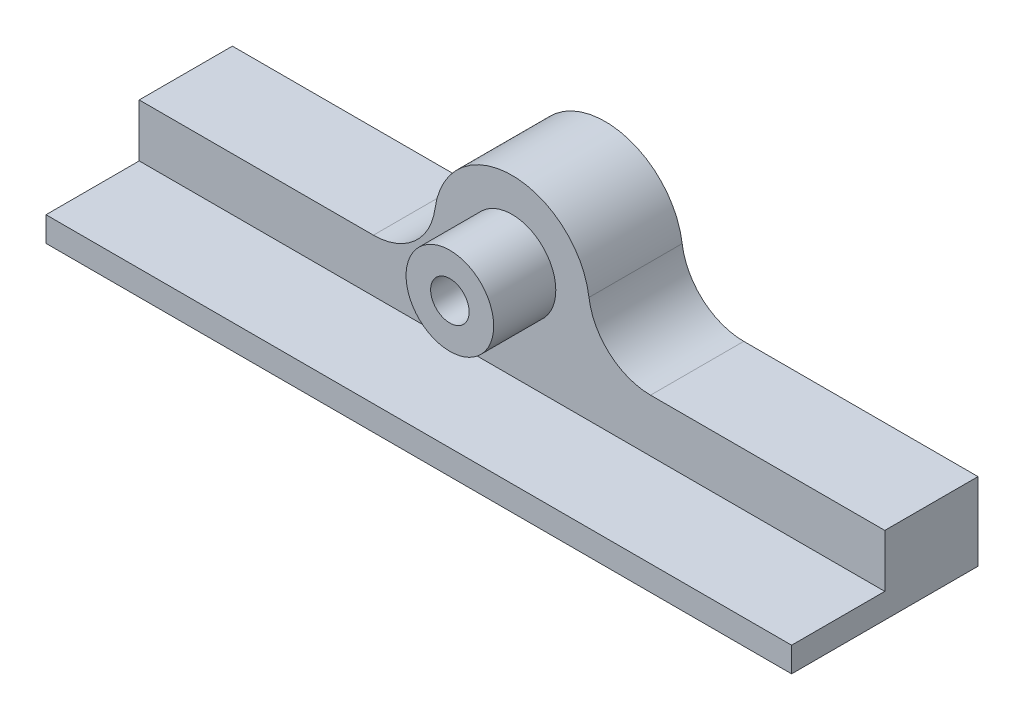
ISO-10303-21;
HEADER;
FILE_DESCRIPTION(('STEP AP214'),'2;1');
FILE_NAME('part.step','',(''),(''),'','','');
FILE_SCHEMA(('AUTOMOTIVE_DESIGN { 1 0 10303 214 1 1 1 1 }'));
ENDSEC;
DATA;
#1=APPLICATION_CONTEXT('core data for automotive mechanical design processes');
#2=APPLICATION_PROTOCOL_DEFINITION('international standard','automotive_design',2000,#1);
#3=PRODUCT_CONTEXT('',#1,'mechanical');
#4=PRODUCT('Part','Part','',(#3));
#5=PRODUCT_RELATED_PRODUCT_CATEGORY('part','',(#4));
#6=PRODUCT_DEFINITION_FORMATION('','',#4);
#7=PRODUCT_DEFINITION_CONTEXT('part definition',#1,'design');
#8=PRODUCT_DEFINITION('design','',#6,#7);
#9=PRODUCT_DEFINITION_SHAPE('','',#8);
#10=(LENGTH_UNIT() NAMED_UNIT(*) SI_UNIT(.MILLI.,.METRE.));
#11=(NAMED_UNIT(*) PLANE_ANGLE_UNIT() SI_UNIT($,.RADIAN.));
#12=(NAMED_UNIT(*) SI_UNIT($,.STERADIAN.) SOLID_ANGLE_UNIT());
#13=UNCERTAINTY_MEASURE_WITH_UNIT(LENGTH_MEASURE(1.E-05),#10,'distance_accuracy_value','');
#14=(GEOMETRIC_REPRESENTATION_CONTEXT(3) GLOBAL_UNCERTAINTY_ASSIGNED_CONTEXT((#13)) GLOBAL_UNIT_ASSIGNED_CONTEXT((#10,
#11,#12)) REPRESENTATION_CONTEXT('',''));
#15=CARTESIAN_POINT('',(0.,0.,0.));
#16=DIRECTION('',(0.,0.,1.));
#17=DIRECTION('',(1.,0.,0.));
#18=AXIS2_PLACEMENT_3D('',#15,#16,#17);
#19=CARTESIAN_POINT('',(0.,0.,0.));
#20=DIRECTION('',(0.,0.,1.));
#21=DIRECTION('',(1.,0.,0.));
#22=AXIS2_PLACEMENT_3D('',#19,#20,#21);
#23=PLANE('',#22);
#24=CARTESIAN_POINT('',(0.,0.,0.));
#25=DIRECTION('',(0.,0.,1.));
#26=DIRECTION('',(1.,0.,0.));
#27=AXIS2_PLACEMENT_3D('',#24,#25,#26);
#28=CIRCLE('',#27,7.05000000000001);
#29=CARTESIAN_POINT('',(7.05000000000001,0.,0.));
#30=VERTEX_POINT('',#29);
#31=EDGE_CURVE('E178',#30,#30,#28,.F.);
#32=ORIENTED_EDGE('',*,*,#31,.T.);
#33=EDGE_LOOP('',(#32));
#34=FACE_BOUND('',#33,.T.);
#35=DIRECTION('',(0.,1.,0.));
#36=VECTOR('',#35,1.);
#37=CARTESIAN_POINT('',(-60.,0.,0.));
#38=LINE('',#37,#36);
#39=CARTESIAN_POINT('',(-60.,-15.5,0.));
#40=VERTEX_POINT('',#39);
#41=CARTESIAN_POINT('',(-60.,-6.99999999999999,0.));
#42=VERTEX_POINT('',#41);
#43=EDGE_CURVE('E165',#40,#42,#38,.T.);
#44=ORIENTED_EDGE('',*,*,#43,.F.);
#45=DIRECTION('',(-1.,0.,0.));
#46=VECTOR('',#45,1.);
#47=CARTESIAN_POINT('',(-60.,-15.5,0.));
#48=LINE('',#47,#46);
#49=CARTESIAN_POINT('',(60.,-15.5,0.));
#50=VERTEX_POINT('',#49);
#51=EDGE_CURVE('E136',#50,#40,#48,.T.);
#52=ORIENTED_EDGE('',*,*,#51,.F.);
#53=DIRECTION('',(0.,1.,0.));
#54=VECTOR('',#53,1.);
#55=CARTESIAN_POINT('',(60.,0.,0.));
#56=LINE('',#55,#54);
#57=CARTESIAN_POINT('',(60.,-7.00000000000001,0.));
#58=VERTEX_POINT('',#57);
#59=EDGE_CURVE('E163',#50,#58,#56,.T.);
#60=ORIENTED_EDGE('',*,*,#59,.T.);
#61=DIRECTION('',(-1.,0.,0.));
#62=VECTOR('',#61,1.);
#63=CARTESIAN_POINT('',(0.,-7.00000000000001,0.));
#64=LINE('',#63,#62);
#65=CARTESIAN_POINT('',(22.2991031209778,-7.00000000000001,0.));
#66=VERTEX_POINT('',#65);
#67=EDGE_CURVE('E145',#58,#66,#64,.T.);
#68=ORIENTED_EDGE('',*,*,#67,.T.);
#69=CARTESIAN_POINT('',(22.2991031209778,2.99999999999999,0.));
#70=DIRECTION('',(0.,0.,1.));
#71=DIRECTION('',(1.,0.,0.));
#72=AXIS2_PLACEMENT_3D('',#69,#70,#71);
#73=CIRCLE('',#72,10.);
#74=CARTESIAN_POINT('',(12.3883906227654,1.66666666666666,0.));
#75=VERTEX_POINT('',#74);
#76=EDGE_CURVE('E45',#66,#75,#73,.F.);
#77=ORIENTED_EDGE('',*,*,#76,.T.);
#78=CARTESIAN_POINT('',(0.,0.,0.));
#79=DIRECTION('',(0.,0.,1.));
#80=DIRECTION('',(1.,0.,0.));
#81=AXIS2_PLACEMENT_3D('',#78,#79,#80);
#82=CIRCLE('',#81,12.5);
#83=CARTESIAN_POINT('',(-12.3883906227654,1.66666666666667,0.));
#84=VERTEX_POINT('',#83);
#85=EDGE_CURVE('E149',#75,#84,#82,.T.);
#86=ORIENTED_EDGE('',*,*,#85,.T.);
#87=CARTESIAN_POINT('',(-22.2991031209778,3.,0.));
#88=DIRECTION('',(0.,0.,1.));
#89=DIRECTION('',(1.,0.,0.));
#90=AXIS2_PLACEMENT_3D('',#87,#88,#89);
#91=CIRCLE('',#90,10.);
#92=CARTESIAN_POINT('',(-22.2991031209778,-7.,0.));
#93=VERTEX_POINT('',#92);
#94=EDGE_CURVE('E200',#84,#93,#91,.F.);
#95=ORIENTED_EDGE('',*,*,#94,.T.);
#96=DIRECTION('',(1.,0.,0.));
#97=VECTOR('',#96,1.);
#98=CARTESIAN_POINT('',(0.,-7.00000000000001,0.));
#99=LINE('',#98,#97);
#100=EDGE_CURVE('E167',#42,#93,#99,.T.);
#101=ORIENTED_EDGE('',*,*,#100,.F.);
#102=EDGE_LOOP('',(#44,#52,#60,#68,#77,#86,#95,#101));
#103=FACE_BOUND('',#102,.T.);
#104=ADVANCED_FACE('F37',(#34,#103),#23,.T.);
#105=CARTESIAN_POINT('',(0.,0.,10.));
#106=DIRECTION('',(0.,0.,-1.));
#107=DIRECTION('',(-1.,0.,0.));
#108=AXIS2_PLACEMENT_3D('',#105,#106,#107);
#109=CYLINDRICAL_SURFACE('',#108,7.05000000000001);
#110=CARTESIAN_POINT('',(0.,0.,10.));
#111=DIRECTION('',(0.,0.,1.));
#112=DIRECTION('',(1.,0.,0.));
#113=AXIS2_PLACEMENT_3D('',#110,#111,#112);
#114=CIRCLE('',#113,7.05000000000001);
#115=CARTESIAN_POINT('',(7.05000000000001,0.,10.));
#116=VERTEX_POINT('',#115);
#117=EDGE_CURVE('E179',#116,#116,#114,.F.);
#118=ORIENTED_EDGE('',*,*,#117,.T.);
#119=EDGE_LOOP('',(#118));
#120=FACE_BOUND('',#119,.T.);
#121=ORIENTED_EDGE('',*,*,#31,.F.);
#122=EDGE_LOOP('',(#121));
#123=FACE_BOUND('',#122,.T.);
#124=ADVANCED_FACE('F240',(#120,#123),#109,.T.);
#125=CARTESIAN_POINT('',(0.,0.,10.));
#126=DIRECTION('',(0.,0.,-1.));
#127=DIRECTION('',(-1.,0.,0.));
#128=AXIS2_PLACEMENT_3D('',#125,#126,#127);
#129=CYLINDRICAL_SURFACE('',#128,3.1);
#130=CARTESIAN_POINT('',(0.,0.,10.));
#131=DIRECTION('',(0.,0.,1.));
#132=DIRECTION('',(1.,0.,0.));
#133=AXIS2_PLACEMENT_3D('',#130,#131,#132);
#134=CIRCLE('',#133,3.1);
#135=CARTESIAN_POINT('',(3.1,0.,10.));
#136=VERTEX_POINT('',#135);
#137=EDGE_CURVE('E182',#136,#136,#134,.T.);
#138=ORIENTED_EDGE('',*,*,#137,.T.);
#139=EDGE_LOOP('',(#138));
#140=FACE_BOUND('',#139,.T.);
#141=CARTESIAN_POINT('',(0.,0.,0.));
#142=DIRECTION('',(0.,0.,1.));
#143=DIRECTION('',(1.,0.,0.));
#144=AXIS2_PLACEMENT_3D('',#141,#142,#143);
#145=CIRCLE('',#144,3.1);
#146=CARTESIAN_POINT('',(3.1,0.,0.));
#147=VERTEX_POINT('',#146);
#148=EDGE_CURVE('E183',#147,#147,#145,.T.);
#149=ORIENTED_EDGE('',*,*,#148,.F.);
#150=EDGE_LOOP('',(#149));
#151=FACE_BOUND('',#150,.T.);
#152=ADVANCED_FACE('F247',(#140,#151),#129,.F.);
#153=CARTESIAN_POINT('',(0.,0.,10.));
#154=DIRECTION('',(0.,0.,1.));
#155=DIRECTION('',(1.,0.,0.));
#156=AXIS2_PLACEMENT_3D('',#153,#154,#155);
#157=PLANE('',#156);
#158=ORIENTED_EDGE('',*,*,#117,.F.);
#159=EDGE_LOOP('',(#158));
#160=FACE_BOUND('',#159,.T.);
#161=ORIENTED_EDGE('',*,*,#137,.F.);
#162=EDGE_LOOP('',(#161));
#163=FACE_BOUND('',#162,.T.);
#164=ADVANCED_FACE('F251',(#160,#163),#157,.T.);
#165=ORIENTED_EDGE('',*,*,#148,.T.);
#166=EDGE_LOOP('',(#165));
#167=FACE_BOUND('',#166,.T.);
#168=ADVANCED_FACE('F243',(#167),#23,.T.);
#169=CARTESIAN_POINT('',(0.,-7.00000000000001,-15.));
#170=DIRECTION('',(0.,1.,0.));
#171=DIRECTION('',(0.,0.,1.));
#172=AXIS2_PLACEMENT_3D('',#169,#170,#171);
#173=PLANE('',#172);
#174=DIRECTION('',(-1.,0.,0.));
#175=VECTOR('',#174,1.);
#176=CARTESIAN_POINT('',(0.,-7.00000000000001,-15.));
#177=LINE('',#176,#175);
#178=CARTESIAN_POINT('',(60.,-7.00000000000001,-15.));
#179=VERTEX_POINT('',#178);
#180=CARTESIAN_POINT('',(22.2991031209778,-7.00000000000001,-15.));
#181=VERTEX_POINT('',#180);
#182=EDGE_CURVE('E146',#179,#181,#177,.T.);
#183=ORIENTED_EDGE('',*,*,#182,.T.);
#184=DIRECTION('',(0.,0.,-1.));
#185=VECTOR('',#184,1.);
#186=CARTESIAN_POINT('',(22.2991031209778,-7.00000000000001,0.));
#187=LINE('',#186,#185);
#188=EDGE_CURVE('E197',#181,#66,#187,.F.);
#189=ORIENTED_EDGE('',*,*,#188,.T.);
#190=ORIENTED_EDGE('',*,*,#67,.F.);
#191=DIRECTION('',(0.,0.,1.));
#192=VECTOR('',#191,1.);
#193=CARTESIAN_POINT('',(60.,-7.00000000000001,-15.));
#194=LINE('',#193,#192);
#195=EDGE_CURVE('E175',#179,#58,#194,.T.);
#196=ORIENTED_EDGE('',*,*,#195,.F.);
#197=EDGE_LOOP('',(#183,#189,#190,#196));
#198=FACE_BOUND('',#197,.T.);
#199=ADVANCED_FACE('F214',(#198),#173,.T.);
#200=CARTESIAN_POINT('',(60.,0.,-15.));
#201=DIRECTION('',(1.,0.,0.));
#202=DIRECTION('',(0.,0.,-1.));
#203=AXIS2_PLACEMENT_3D('',#200,#201,#202);
#204=PLANE('',#203);
#205=ORIENTED_EDGE('',*,*,#59,.F.);
#206=DIRECTION('',(0.,0.,-1.));
#207=VECTOR('',#206,1.);
#208=CARTESIAN_POINT('',(60.,-15.5,15.));
#209=LINE('',#208,#207);
#210=CARTESIAN_POINT('',(60.,-15.5,15.));
#211=VERTEX_POINT('',#210);
#212=EDGE_CURVE('E143',#211,#50,#209,.T.);
#213=ORIENTED_EDGE('',*,*,#212,.F.);
#214=DIRECTION('',(0.,1.,0.));
#215=VECTOR('',#214,1.);
#216=CARTESIAN_POINT('',(60.,-19.5,15.));
#217=LINE('',#216,#215);
#218=CARTESIAN_POINT('',(60.,-19.5,15.));
#219=VERTEX_POINT('',#218);
#220=EDGE_CURVE('E131',#219,#211,#217,.T.);
#221=ORIENTED_EDGE('',*,*,#220,.F.);
#222=DIRECTION('',(0.,0.,1.));
#223=VECTOR('',#222,1.);
#224=CARTESIAN_POINT('',(60.,-19.5,-15.));
#225=LINE('',#224,#223);
#226=CARTESIAN_POINT('',(60.,-19.5,-15.));
#227=VERTEX_POINT('',#226);
#228=EDGE_CURVE('E123',#227,#219,#225,.T.);
#229=ORIENTED_EDGE('',*,*,#228,.F.);
#230=DIRECTION('',(0.,1.,0.));
#231=VECTOR('',#230,1.);
#232=CARTESIAN_POINT('',(60.,0.,-15.));
#233=LINE('',#232,#231);
#234=EDGE_CURVE('E148',#227,#179,#233,.T.);
#235=ORIENTED_EDGE('',*,*,#234,.T.);
#236=ORIENTED_EDGE('',*,*,#195,.T.);
#237=EDGE_LOOP('',(#205,#213,#221,#229,#235,#236));
#238=FACE_BOUND('',#237,.T.);
#239=ADVANCED_FACE('F219',(#238),#204,.T.);
#240=CARTESIAN_POINT('',(0.,-19.5,-15.));
#241=DIRECTION('',(0.,-1.,0.));
#242=DIRECTION('',(0.,0.,-1.));
#243=AXIS2_PLACEMENT_3D('',#240,#241,#242);
#244=PLANE('',#243);
#245=ORIENTED_EDGE('',*,*,#228,.T.);
#246=DIRECTION('',(1.,0.,0.));
#247=VECTOR('',#246,1.);
#248=CARTESIAN_POINT('',(-60.,-19.5,15.));
#249=LINE('',#248,#247);
#250=CARTESIAN_POINT('',(-60.,-19.5,15.));
#251=VERTEX_POINT('',#250);
#252=EDGE_CURVE('E127',#251,#219,#249,.T.);
#253=ORIENTED_EDGE('',*,*,#252,.F.);
#254=DIRECTION('',(0.,0.,1.));
#255=VECTOR('',#254,1.);
#256=CARTESIAN_POINT('',(-60.,-19.5,-15.));
#257=LINE('',#256,#255);
#258=CARTESIAN_POINT('',(-60.,-19.5,-15.));
#259=VERTEX_POINT('',#258);
#260=EDGE_CURVE('E113',#259,#251,#257,.T.);
#261=ORIENTED_EDGE('',*,*,#260,.F.);
#262=DIRECTION('',(1.,0.,0.));
#263=VECTOR('',#262,1.);
#264=CARTESIAN_POINT('',(0.,-19.5,-15.));
#265=LINE('',#264,#263);
#266=EDGE_CURVE('E152',#259,#227,#265,.T.);
#267=ORIENTED_EDGE('',*,*,#266,.T.);
#268=EDGE_LOOP('',(#245,#253,#261,#267));
#269=FACE_BOUND('',#268,.T.);
#270=ADVANCED_FACE('F128',(#269),#244,.T.);
#271=CARTESIAN_POINT('',(-60.,0.,-15.));
#272=DIRECTION('',(1.,0.,0.));
#273=DIRECTION('',(0.,0.,-1.));
#274=AXIS2_PLACEMENT_3D('',#271,#272,#273);
#275=PLANE('',#274);
#276=ORIENTED_EDGE('',*,*,#260,.T.);
#277=DIRECTION('',(0.,-1.,0.));
#278=VECTOR('',#277,1.);
#279=CARTESIAN_POINT('',(-60.,-19.5,15.));
#280=LINE('',#279,#278);
#281=CARTESIAN_POINT('',(-60.,-15.5,15.));
#282=VERTEX_POINT('',#281);
#283=EDGE_CURVE('E117',#282,#251,#280,.T.);
#284=ORIENTED_EDGE('',*,*,#283,.F.);
#285=DIRECTION('',(0.,0.,-1.));
#286=VECTOR('',#285,1.);
#287=CARTESIAN_POINT('',(-60.,-15.5,15.));
#288=LINE('',#287,#286);
#289=EDGE_CURVE('E52',#282,#40,#288,.T.);
#290=ORIENTED_EDGE('',*,*,#289,.T.);
#291=ORIENTED_EDGE('',*,*,#43,.T.);
#292=DIRECTION('',(0.,0.,1.));
#293=VECTOR('',#292,1.);
#294=CARTESIAN_POINT('',(-60.,-6.99999999999999,-15.));
#295=LINE('',#294,#293);
#296=CARTESIAN_POINT('',(-60.,-6.99999999999999,-15.));
#297=VERTEX_POINT('',#296);
#298=EDGE_CURVE('E124',#297,#42,#295,.T.);
#299=ORIENTED_EDGE('',*,*,#298,.F.);
#300=DIRECTION('',(0.,1.,0.));
#301=VECTOR('',#300,1.);
#302=CARTESIAN_POINT('',(-60.,0.,-15.));
#303=LINE('',#302,#301);
#304=EDGE_CURVE('E119',#259,#297,#303,.T.);
#305=ORIENTED_EDGE('',*,*,#304,.F.);
#306=EDGE_LOOP('',(#276,#284,#290,#291,#299,#305));
#307=FACE_BOUND('',#306,.T.);
#308=ADVANCED_FACE('F115',(#307),#275,.F.);
#309=CARTESIAN_POINT('',(0.,-7.00000000000001,-15.));
#310=DIRECTION('',(0.,-1.,0.));
#311=DIRECTION('',(1.,0.,0.));
#312=AXIS2_PLACEMENT_3D('',#309,#310,#311);
#313=PLANE('',#312);
#314=ORIENTED_EDGE('',*,*,#100,.T.);
#315=DIRECTION('',(0.,0.,1.));
#316=VECTOR('',#315,1.);
#317=CARTESIAN_POINT('',(-22.2991031209778,-7.,-15.));
#318=LINE('',#317,#316);
#319=CARTESIAN_POINT('',(-22.2991031209778,-7.,-15.));
#320=VERTEX_POINT('',#319);
#321=EDGE_CURVE('E195',#93,#320,#318,.F.);
#322=ORIENTED_EDGE('',*,*,#321,.T.);
#323=DIRECTION('',(1.,0.,0.));
#324=VECTOR('',#323,1.);
#325=CARTESIAN_POINT('',(0.,-7.00000000000001,-15.));
#326=LINE('',#325,#324);
#327=EDGE_CURVE('E155',#297,#320,#326,.T.);
#328=ORIENTED_EDGE('',*,*,#327,.F.);
#329=ORIENTED_EDGE('',*,*,#298,.T.);
#330=EDGE_LOOP('',(#314,#322,#328,#329));
#331=FACE_BOUND('',#330,.T.);
#332=ADVANCED_FACE('F227',(#331),#313,.F.);
#333=CARTESIAN_POINT('',(0.,0.,-15.));
#334=DIRECTION('',(0.,0.,1.));
#335=DIRECTION('',(1.,0.,0.));
#336=AXIS2_PLACEMENT_3D('',#333,#334,#335);
#337=CYLINDRICAL_SURFACE('',#336,12.5);
#338=CARTESIAN_POINT('',(0.,0.,-15.));
#339=DIRECTION('',(0.,0.,1.));
#340=DIRECTION('',(1.,0.,0.));
#341=AXIS2_PLACEMENT_3D('',#338,#339,#340);
#342=CIRCLE('',#341,12.5);
#343=CARTESIAN_POINT('',(12.3883906227654,1.66666666666666,-15.));
#344=VERTEX_POINT('',#343);
#345=CARTESIAN_POINT('',(-12.3883906227654,1.66666666666667,-15.));
#346=VERTEX_POINT('',#345);
#347=EDGE_CURVE('E158',#344,#346,#342,.T.);
#348=ORIENTED_EDGE('',*,*,#347,.T.);
#349=DIRECTION('',(0.,0.,1.));
#350=VECTOR('',#349,1.);
#351=CARTESIAN_POINT('',(-12.3883906227654,1.66666666666667,-15.));
#352=LINE('',#351,#350);
#353=EDGE_CURVE('E192',#346,#84,#352,.T.);
#354=ORIENTED_EDGE('',*,*,#353,.T.);
#355=ORIENTED_EDGE('',*,*,#85,.F.);
#356=DIRECTION('',(0.,0.,1.));
#357=VECTOR('',#356,1.);
#358=CARTESIAN_POINT('',(12.3883906227654,1.66666666666666,-15.));
#359=LINE('',#358,#357);
#360=EDGE_CURVE('E186',#75,#344,#359,.F.);
#361=ORIENTED_EDGE('',*,*,#360,.T.);
#362=EDGE_LOOP('',(#348,#354,#355,#361));
#363=FACE_BOUND('',#362,.T.);
#364=ADVANCED_FACE('F211',(#363),#337,.T.);
#365=CARTESIAN_POINT('',(0.,0.,-15.));
#366=DIRECTION('',(0.,0.,1.));
#367=DIRECTION('',(1.,0.,0.));
#368=AXIS2_PLACEMENT_3D('',#365,#366,#367);
#369=PLANE('',#368);
#370=ORIENTED_EDGE('',*,*,#347,.F.);
#371=CARTESIAN_POINT('',(22.2991031209778,2.99999999999999,-15.));
#372=DIRECTION('',(0.,0.,1.));
#373=DIRECTION('',(1.,0.,0.));
#374=AXIS2_PLACEMENT_3D('',#371,#372,#373);
#375=CIRCLE('',#374,10.);
#376=EDGE_CURVE('E11',#344,#181,#375,.T.);
#377=ORIENTED_EDGE('',*,*,#376,.T.);
#378=ORIENTED_EDGE('',*,*,#182,.F.);
#379=ORIENTED_EDGE('',*,*,#234,.F.);
#380=ORIENTED_EDGE('',*,*,#266,.F.);
#381=ORIENTED_EDGE('',*,*,#304,.T.);
#382=ORIENTED_EDGE('',*,*,#327,.T.);
#383=CARTESIAN_POINT('',(-22.2991031209778,3.,-15.));
#384=DIRECTION('',(0.,0.,1.));
#385=DIRECTION('',(1.,0.,0.));
#386=AXIS2_PLACEMENT_3D('',#383,#384,#385);
#387=CIRCLE('',#386,10.);
#388=EDGE_CURVE('E202',#320,#346,#387,.T.);
#389=ORIENTED_EDGE('',*,*,#388,.T.);
#390=EDGE_LOOP('',(#370,#377,#378,#379,#380,#381,#382,#389));
#391=FACE_BOUND('',#390,.T.);
#392=ADVANCED_FACE('F216',(#391),#369,.F.);
#393=CARTESIAN_POINT('',(-22.2991031209778,3.,-15.));
#394=DIRECTION('',(0.,0.,1.));
#395=DIRECTION('',(1.,0.,0.));
#396=AXIS2_PLACEMENT_3D('',#393,#394,#395);
#397=CYLINDRICAL_SURFACE('',#396,10.);
#398=ORIENTED_EDGE('',*,*,#388,.F.);
#399=ORIENTED_EDGE('',*,*,#321,.F.);
#400=ORIENTED_EDGE('',*,*,#94,.F.);
#401=ORIENTED_EDGE('',*,*,#353,.F.);
#402=EDGE_LOOP('',(#398,#399,#400,#401));
#403=FACE_BOUND('',#402,.T.);
#404=ADVANCED_FACE('F231',(#403),#397,.F.);
#405=CARTESIAN_POINT('',(22.2991031209778,2.99999999999999,-15.));
#406=DIRECTION('',(0.,0.,1.));
#407=DIRECTION('',(1.,0.,0.));
#408=AXIS2_PLACEMENT_3D('',#405,#406,#407);
#409=CYLINDRICAL_SURFACE('',#408,10.);
#410=ORIENTED_EDGE('',*,*,#376,.F.);
#411=ORIENTED_EDGE('',*,*,#360,.F.);
#412=ORIENTED_EDGE('',*,*,#76,.F.);
#413=ORIENTED_EDGE('',*,*,#188,.F.);
#414=EDGE_LOOP('',(#410,#411,#412,#413));
#415=FACE_BOUND('',#414,.T.);
#416=ADVANCED_FACE('F39',(#415),#409,.F.);
#417=CARTESIAN_POINT('',(-60.,-15.5,15.));
#418=DIRECTION('',(0.,-1.,0.));
#419=DIRECTION('',(0.,0.,-1.));
#420=AXIS2_PLACEMENT_3D('',#417,#418,#419);
#421=PLANE('',#420);
#422=ORIENTED_EDGE('',*,*,#51,.T.);
#423=ORIENTED_EDGE('',*,*,#289,.F.);
#424=DIRECTION('',(-1.,0.,0.));
#425=VECTOR('',#424,1.);
#426=CARTESIAN_POINT('',(-60.,-15.5,15.));
#427=LINE('',#426,#425);
#428=EDGE_CURVE('E135',#211,#282,#427,.T.);
#429=ORIENTED_EDGE('',*,*,#428,.F.);
#430=ORIENTED_EDGE('',*,*,#212,.T.);
#431=EDGE_LOOP('',(#422,#423,#429,#430));
#432=FACE_BOUND('',#431,.T.);
#433=ADVANCED_FACE('F223',(#432),#421,.F.);
#434=CARTESIAN_POINT('',(0.,0.,15.));
#435=DIRECTION('',(0.,0.,-1.));
#436=DIRECTION('',(-1.,0.,0.));
#437=AXIS2_PLACEMENT_3D('',#434,#435,#436);
#438=PLANE('',#437);
#439=ORIENTED_EDGE('',*,*,#283,.T.);
#440=ORIENTED_EDGE('',*,*,#252,.T.);
#441=ORIENTED_EDGE('',*,*,#220,.T.);
#442=ORIENTED_EDGE('',*,*,#428,.T.);
#443=EDGE_LOOP('',(#439,#440,#441,#442));
#444=FACE_BOUND('',#443,.T.);
#445=ADVANCED_FACE('F133',(#444),#438,.F.);
#446=CLOSED_SHELL('',(#104,#124,#152,#164,#168,#199,#239,#270,#308,#332,#364,#392,#404,#416,
#433,#445));
#447=MANIFOLD_SOLID_BREP('B2',#446);
#448=ADVANCED_BREP_SHAPE_REPRESENTATION('',(#18,#447),#14);
#449=SHAPE_DEFINITION_REPRESENTATION(#9,#448);
ENDSEC;
END-ISO-10303-21;
